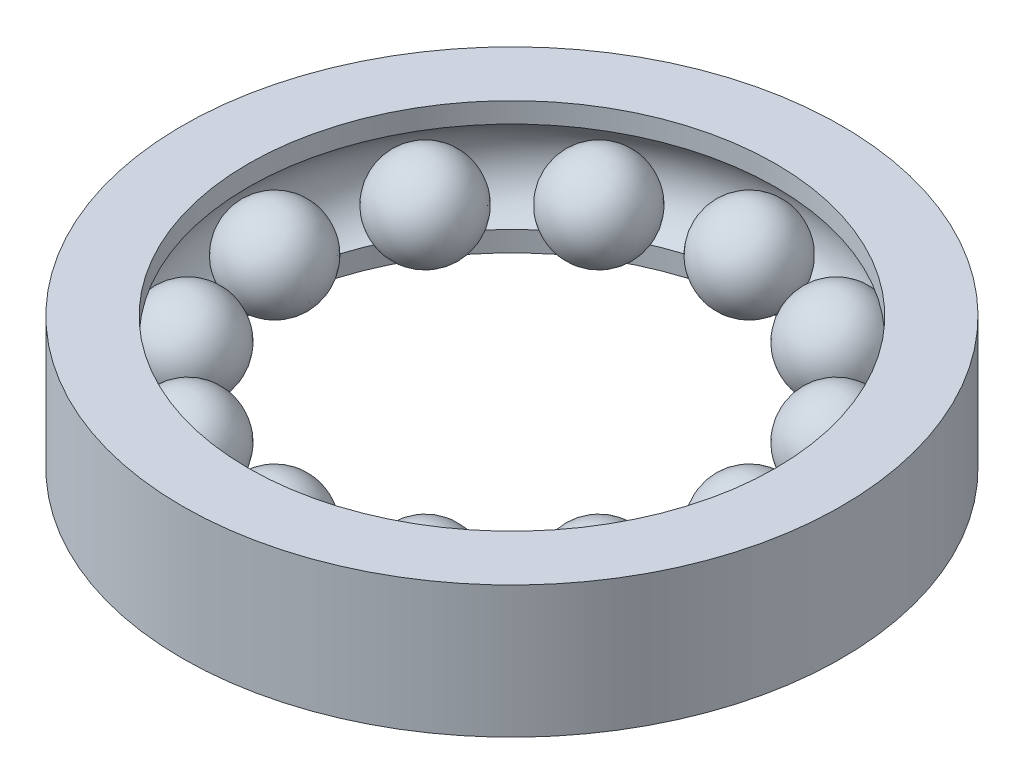
ISO-10303-21;
HEADER;
FILE_DESCRIPTION(('STEP AP214'),'2;1');
FILE_NAME('part.step','',(''),(''),'','','');
FILE_SCHEMA(('AUTOMOTIVE_DESIGN { 1 0 10303 214 1 1 1 1 }'));
ENDSEC;
DATA;
#1=APPLICATION_CONTEXT('core data for automotive mechanical design processes');
#2=APPLICATION_PROTOCOL_DEFINITION('international standard','automotive_design',2000,#1);
#3=PRODUCT_CONTEXT('',#1,'mechanical');
#4=PRODUCT('Part','Part','',(#3));
#5=PRODUCT_RELATED_PRODUCT_CATEGORY('part','',(#4));
#6=PRODUCT_DEFINITION_FORMATION('','',#4);
#7=PRODUCT_DEFINITION_CONTEXT('part definition',#1,'design');
#8=PRODUCT_DEFINITION('design','',#6,#7);
#9=PRODUCT_DEFINITION_SHAPE('','',#8);
#10=(LENGTH_UNIT() NAMED_UNIT(*) SI_UNIT(.MILLI.,.METRE.));
#11=(NAMED_UNIT(*) PLANE_ANGLE_UNIT() SI_UNIT($,.RADIAN.));
#12=(NAMED_UNIT(*) SI_UNIT($,.STERADIAN.) SOLID_ANGLE_UNIT());
#13=UNCERTAINTY_MEASURE_WITH_UNIT(LENGTH_MEASURE(1.E-05),#10,'distance_accuracy_value','');
#14=(GEOMETRIC_REPRESENTATION_CONTEXT(3) GLOBAL_UNCERTAINTY_ASSIGNED_CONTEXT((#13)) GLOBAL_UNIT_ASSIGNED_CONTEXT((#10,
#11,#12)) REPRESENTATION_CONTEXT('',''));
#15=CARTESIAN_POINT('',(0.,0.,0.));
#16=DIRECTION('',(0.,0.,1.));
#17=DIRECTION('',(1.,0.,0.));
#18=AXIS2_PLACEMENT_3D('',#15,#16,#17);
#19=CARTESIAN_POINT('',(1.55884572681199,0.,0.899999999999996));
#20=DIRECTION('',(0.,0.,-1.));
#21=DIRECTION('',(1.,0.,0.));
#22=AXIS2_PLACEMENT_3D('',#19,#20,#21);
#23=SPHERICAL_SURFACE('',#22,0.35);
#24=CARTESIAN_POINT('',(1.55884572681199,0.,0.549999999999996));
#25=VERTEX_POINT('',#24);
#26=VERTEX_LOOP('',#25);
#27=FACE_BOUND('',#26,.T.);
#28=ADVANCED_FACE('F37',(#27),#23,.T.);
#29=CLOSED_SHELL('',(#28));
#30=MANIFOLD_SOLID_BREP('B2',#29);
#31=CARTESIAN_POINT('',(0.900000000000002,0.,1.55884572681199));
#32=DIRECTION('',(0.,0.,-1.));
#33=DIRECTION('',(1.,0.,0.));
#34=AXIS2_PLACEMENT_3D('',#31,#32,#33);
#35=SPHERICAL_SURFACE('',#34,0.35);
#36=CARTESIAN_POINT('',(0.900000000000002,0.,1.20884572681199));
#37=VERTEX_POINT('',#36);
#38=VERTEX_LOOP('',#37);
#39=FACE_BOUND('',#38,.T.);
#40=ADVANCED_FACE('F57',(#39),#35,.T.);
#41=CLOSED_SHELL('',(#40));
#42=MANIFOLD_SOLID_BREP('B6',#41);
#43=CARTESIAN_POINT('',(0.,0.,1.8));
#44=DIRECTION('',(0.,0.,-1.));
#45=DIRECTION('',(1.,0.,0.));
#46=AXIS2_PLACEMENT_3D('',#43,#44,#45);
#47=SPHERICAL_SURFACE('',#46,0.35);
#48=CARTESIAN_POINT('',(0.,0.,1.45));
#49=VERTEX_POINT('',#48);
#50=VERTEX_LOOP('',#49);
#51=FACE_BOUND('',#50,.T.);
#52=ADVANCED_FACE('F77',(#51),#47,.T.);
#53=CLOSED_SHELL('',(#52));
#54=MANIFOLD_SOLID_BREP('B33',#53);
#55=CARTESIAN_POINT('',(-0.899999999999996,0.,1.55884572681199));
#56=DIRECTION('',(0.,0.,-1.));
#57=DIRECTION('',(1.,0.,0.));
#58=AXIS2_PLACEMENT_3D('',#55,#56,#57);
#59=SPHERICAL_SURFACE('',#58,0.35);
#60=CARTESIAN_POINT('',(-0.899999999999996,0.,1.20884572681199));
#61=VERTEX_POINT('',#60);
#62=VERTEX_LOOP('',#61);
#63=FACE_BOUND('',#62,.T.);
#64=ADVANCED_FACE('F97',(#63),#59,.T.);
#65=CLOSED_SHELL('',(#64));
#66=MANIFOLD_SOLID_BREP('B53',#65);
#67=CARTESIAN_POINT('',(-1.55884572681199,0.,0.900000000000002));
#68=DIRECTION('',(0.,0.,-1.));
#69=DIRECTION('',(1.,0.,0.));
#70=AXIS2_PLACEMENT_3D('',#67,#68,#69);
#71=SPHERICAL_SURFACE('',#70,0.35);
#72=CARTESIAN_POINT('',(-1.55884572681199,0.,0.550000000000002));
#73=VERTEX_POINT('',#72);
#74=VERTEX_LOOP('',#73);
#75=FACE_BOUND('',#74,.T.);
#76=ADVANCED_FACE('F117',(#75),#71,.T.);
#77=CLOSED_SHELL('',(#76));
#78=MANIFOLD_SOLID_BREP('B73',#77);
#79=CARTESIAN_POINT('',(-1.8,0.,0.));
#80=DIRECTION('',(0.,0.,-1.));
#81=DIRECTION('',(1.,0.,0.));
#82=AXIS2_PLACEMENT_3D('',#79,#80,#81);
#83=SPHERICAL_SURFACE('',#82,0.35);
#84=CARTESIAN_POINT('',(-1.8,0.,-0.35));
#85=VERTEX_POINT('',#84);
#86=VERTEX_LOOP('',#85);
#87=FACE_BOUND('',#86,.T.);
#88=ADVANCED_FACE('F137',(#87),#83,.T.);
#89=CLOSED_SHELL('',(#88));
#90=MANIFOLD_SOLID_BREP('B93',#89);
#91=CARTESIAN_POINT('',(-1.55884572681199,0.,-0.899999999999996));
#92=DIRECTION('',(0.,0.,-1.));
#93=DIRECTION('',(1.,0.,0.));
#94=AXIS2_PLACEMENT_3D('',#91,#92,#93);
#95=SPHERICAL_SURFACE('',#94,0.35);
#96=CARTESIAN_POINT('',(-1.55884572681199,0.,-1.25));
#97=VERTEX_POINT('',#96);
#98=VERTEX_LOOP('',#97);
#99=FACE_BOUND('',#98,.T.);
#100=ADVANCED_FACE('F157',(#99),#95,.T.);
#101=CLOSED_SHELL('',(#100));
#102=MANIFOLD_SOLID_BREP('B113',#101);
#103=CARTESIAN_POINT('',(-0.900000000000002,0.,-1.55884572681199));
#104=DIRECTION('',(0.,0.,-1.));
#105=DIRECTION('',(1.,0.,0.));
#106=AXIS2_PLACEMENT_3D('',#103,#104,#105);
#107=SPHERICAL_SURFACE('',#106,0.35);
#108=CARTESIAN_POINT('',(-0.900000000000002,0.,-1.90884572681199));
#109=VERTEX_POINT('',#108);
#110=VERTEX_LOOP('',#109);
#111=FACE_BOUND('',#110,.T.);
#112=ADVANCED_FACE('F177',(#111),#107,.T.);
#113=CLOSED_SHELL('',(#112));
#114=MANIFOLD_SOLID_BREP('B133',#113);
#115=CARTESIAN_POINT('',(0.,0.,-1.8));
#116=DIRECTION('',(0.,0.,1.));
#117=DIRECTION('',(-1.,0.,0.));
#118=AXIS2_PLACEMENT_3D('',#115,#116,#117);
#119=SPHERICAL_SURFACE('',#118,0.35);
#120=CARTESIAN_POINT('',(0.,0.,-1.45));
#121=VERTEX_POINT('',#120);
#122=VERTEX_LOOP('',#121);
#123=FACE_BOUND('',#122,.T.);
#124=ADVANCED_FACE('F197',(#123),#119,.T.);
#125=CLOSED_SHELL('',(#124));
#126=MANIFOLD_SOLID_BREP('B153',#125);
#127=CARTESIAN_POINT('',(0.899999999999996,0.,-1.55884572681199));
#128=DIRECTION('',(0.,0.,-1.));
#129=DIRECTION('',(1.,0.,0.));
#130=AXIS2_PLACEMENT_3D('',#127,#128,#129);
#131=SPHERICAL_SURFACE('',#130,0.35);
#132=CARTESIAN_POINT('',(0.899999999999996,0.,-1.90884572681199));
#133=VERTEX_POINT('',#132);
#134=VERTEX_LOOP('',#133);
#135=FACE_BOUND('',#134,.T.);
#136=ADVANCED_FACE('F217',(#135),#131,.T.);
#137=CLOSED_SHELL('',(#136));
#138=MANIFOLD_SOLID_BREP('B173',#137);
#139=CARTESIAN_POINT('',(1.55884572681199,0.,-0.900000000000002));
#140=DIRECTION('',(0.,0.,-1.));
#141=DIRECTION('',(1.,0.,0.));
#142=AXIS2_PLACEMENT_3D('',#139,#140,#141);
#143=SPHERICAL_SURFACE('',#142,0.35);
#144=CARTESIAN_POINT('',(1.55884572681199,0.,-1.25));
#145=VERTEX_POINT('',#144);
#146=VERTEX_LOOP('',#145);
#147=FACE_BOUND('',#146,.T.);
#148=ADVANCED_FACE('F237',(#147),#143,.T.);
#149=CLOSED_SHELL('',(#148));
#150=MANIFOLD_SOLID_BREP('B193',#149);
#151=CARTESIAN_POINT('',(1.8,0.,0.));
#152=DIRECTION('',(0.,0.,-1.));
#153=DIRECTION('',(1.,0.,0.));
#154=AXIS2_PLACEMENT_3D('',#151,#152,#153);
#155=SPHERICAL_SURFACE('',#154,0.35);
#156=CARTESIAN_POINT('',(1.8,0.,-0.35));
#157=VERTEX_POINT('',#156);
#158=VERTEX_LOOP('',#157);
#159=FACE_BOUND('',#158,.T.);
#160=ADVANCED_FACE('F258',(#159),#155,.T.);
#161=CLOSED_SHELL('',(#160));
#162=MANIFOLD_SOLID_BREP('B213',#161);
#163=CARTESIAN_POINT('',(0.,0.5,0.));
#164=DIRECTION('',(0.,1.,0.));
#165=DIRECTION('',(0.,0.,1.));
#166=AXIS2_PLACEMENT_3D('',#163,#164,#165);
#167=CYLINDRICAL_SURFACE('',#166,2.5);
#168=CARTESIAN_POINT('',(0.,0.5,0.));
#169=DIRECTION('',(0.,1.,0.));
#170=DIRECTION('',(0.,0.,1.));
#171=AXIS2_PLACEMENT_3D('',#168,#169,#170);
#172=CIRCLE('',#171,2.5);
#173=CARTESIAN_POINT('',(0.,0.5,2.5));
#174=VERTEX_POINT('',#173);
#175=EDGE_CURVE('E257',#174,#174,#172,.T.);
#176=ORIENTED_EDGE('',*,*,#175,.F.);
#177=EDGE_LOOP('',(#176));
#178=FACE_BOUND('',#177,.T.);
#179=CARTESIAN_POINT('',(0.,-0.5,0.));
#180=DIRECTION('',(0.,1.,0.));
#181=DIRECTION('',(0.,0.,1.));
#182=AXIS2_PLACEMENT_3D('',#179,#180,#181);
#183=CIRCLE('',#182,2.5);
#184=CARTESIAN_POINT('',(0.,-0.5,2.5));
#185=VERTEX_POINT('',#184);
#186=EDGE_CURVE('E294',#185,#185,#183,.T.);
#187=ORIENTED_EDGE('',*,*,#186,.T.);
#188=EDGE_LOOP('',(#187));
#189=FACE_BOUND('',#188,.T.);
#190=ADVANCED_FACE('F272',(#178,#189),#167,.T.);
#191=CARTESIAN_POINT('',(2.,0.5,0.));
#192=DIRECTION('',(0.,-1.,0.));
#193=DIRECTION('',(0.,0.,-1.));
#194=AXIS2_PLACEMENT_3D('',#191,#192,#193);
#195=PLANE('',#194);
#196=CARTESIAN_POINT('',(0.,0.5,0.));
#197=DIRECTION('',(0.,1.,0.));
#198=DIRECTION('',(0.,0.,1.));
#199=AXIS2_PLACEMENT_3D('',#196,#197,#198);
#200=CIRCLE('',#199,2.);
#201=CARTESIAN_POINT('',(0.,0.5,2.));
#202=VERTEX_POINT('',#201);
#203=EDGE_CURVE('E278',#202,#202,#200,.T.);
#204=ORIENTED_EDGE('',*,*,#203,.F.);
#205=EDGE_LOOP('',(#204));
#206=FACE_BOUND('',#205,.T.);
#207=ORIENTED_EDGE('',*,*,#175,.T.);
#208=EDGE_LOOP('',(#207));
#209=FACE_BOUND('',#208,.T.);
#210=ADVANCED_FACE('F319',(#206,#209),#195,.F.);
#211=CARTESIAN_POINT('',(0.,0.5,0.));
#212=DIRECTION('',(0.,1.,0.));
#213=DIRECTION('',(0.,0.,1.));
#214=AXIS2_PLACEMENT_3D('',#211,#212,#213);
#215=CYLINDRICAL_SURFACE('',#214,2.);
#216=CARTESIAN_POINT('',(0.,0.346410161513775,0.));
#217=DIRECTION('',(0.,1.,0.));
#218=DIRECTION('',(0.,0.,1.));
#219=AXIS2_PLACEMENT_3D('',#216,#217,#218);
#220=CIRCLE('',#219,2.);
#221=CARTESIAN_POINT('',(0.,0.346410161513775,2.));
#222=VERTEX_POINT('',#221);
#223=EDGE_CURVE('E282',#222,#222,#220,.T.);
#224=ORIENTED_EDGE('',*,*,#223,.F.);
#225=EDGE_LOOP('',(#224));
#226=FACE_BOUND('',#225,.T.);
#227=ORIENTED_EDGE('',*,*,#203,.T.);
#228=EDGE_LOOP('',(#227));
#229=FACE_BOUND('',#228,.T.);
#230=ADVANCED_FACE('F314',(#226,#229),#215,.F.);
#231=CARTESIAN_POINT('',(0.,0.,0.));
#232=DIRECTION('',(0.,1.,0.));
#233=DIRECTION('',(0.,0.,1.));
#234=AXIS2_PLACEMENT_3D('',#231,#232,#233);
#235=TOROIDAL_SURFACE('',#234,1.8,0.4);
#236=CARTESIAN_POINT('',(0.,-0.346410161513775,0.));
#237=DIRECTION('',(0.,1.,0.));
#238=DIRECTION('',(0.,0.,1.));
#239=AXIS2_PLACEMENT_3D('',#236,#237,#238);
#240=CIRCLE('',#239,2.);
#241=CARTESIAN_POINT('',(0.,-0.346410161513775,2.));
#242=VERTEX_POINT('',#241);
#243=EDGE_CURVE('E286',#242,#242,#240,.T.);
#244=ORIENTED_EDGE('',*,*,#243,.F.);
#245=EDGE_LOOP('',(#244));
#246=FACE_BOUND('',#245,.T.);
#247=ORIENTED_EDGE('',*,*,#223,.T.);
#248=EDGE_LOOP('',(#247));
#249=FACE_BOUND('',#248,.T.);
#250=ADVANCED_FACE('F308',(#246,#249),#235,.F.);
#251=CARTESIAN_POINT('',(0.,0.5,0.));
#252=DIRECTION('',(0.,1.,0.));
#253=DIRECTION('',(0.,0.,1.));
#254=AXIS2_PLACEMENT_3D('',#251,#252,#253);
#255=CYLINDRICAL_SURFACE('',#254,2.);
#256=CARTESIAN_POINT('',(0.,-0.5,0.));
#257=DIRECTION('',(0.,1.,0.));
#258=DIRECTION('',(0.,0.,1.));
#259=AXIS2_PLACEMENT_3D('',#256,#257,#258);
#260=CIRCLE('',#259,2.);
#261=CARTESIAN_POINT('',(0.,-0.5,2.));
#262=VERTEX_POINT('',#261);
#263=EDGE_CURVE('E291',#262,#262,#260,.T.);
#264=ORIENTED_EDGE('',*,*,#263,.F.);
#265=EDGE_LOOP('',(#264));
#266=FACE_BOUND('',#265,.T.);
#267=ORIENTED_EDGE('',*,*,#243,.T.);
#268=EDGE_LOOP('',(#267));
#269=FACE_BOUND('',#268,.T.);
#270=ADVANCED_FACE('F302',(#266,#269),#255,.F.);
#271=CARTESIAN_POINT('',(2.,-0.5,0.));
#272=DIRECTION('',(0.,1.,0.));
#273=DIRECTION('',(0.,0.,1.));
#274=AXIS2_PLACEMENT_3D('',#271,#272,#273);
#275=PLANE('',#274);
#276=ORIENTED_EDGE('',*,*,#186,.F.);
#277=EDGE_LOOP('',(#276));
#278=FACE_BOUND('',#277,.T.);
#279=ORIENTED_EDGE('',*,*,#263,.T.);
#280=EDGE_LOOP('',(#279));
#281=FACE_BOUND('',#280,.T.);
#282=ADVANCED_FACE('F299',(#278,#281),#275,.F.);
#283=CLOSED_SHELL('',(#190,#210,#230,#250,#270,#282));
#284=MANIFOLD_SOLID_BREP('B233',#283);
#285=ADVANCED_BREP_SHAPE_REPRESENTATION('',(#18,#30,#42,#54,#66,#78,#90,#102,#114,#126,#138,
#150,#162,#284),#14);
#286=SHAPE_DEFINITION_REPRESENTATION(#9,#285);
ENDSEC;
END-ISO-10303-21;
